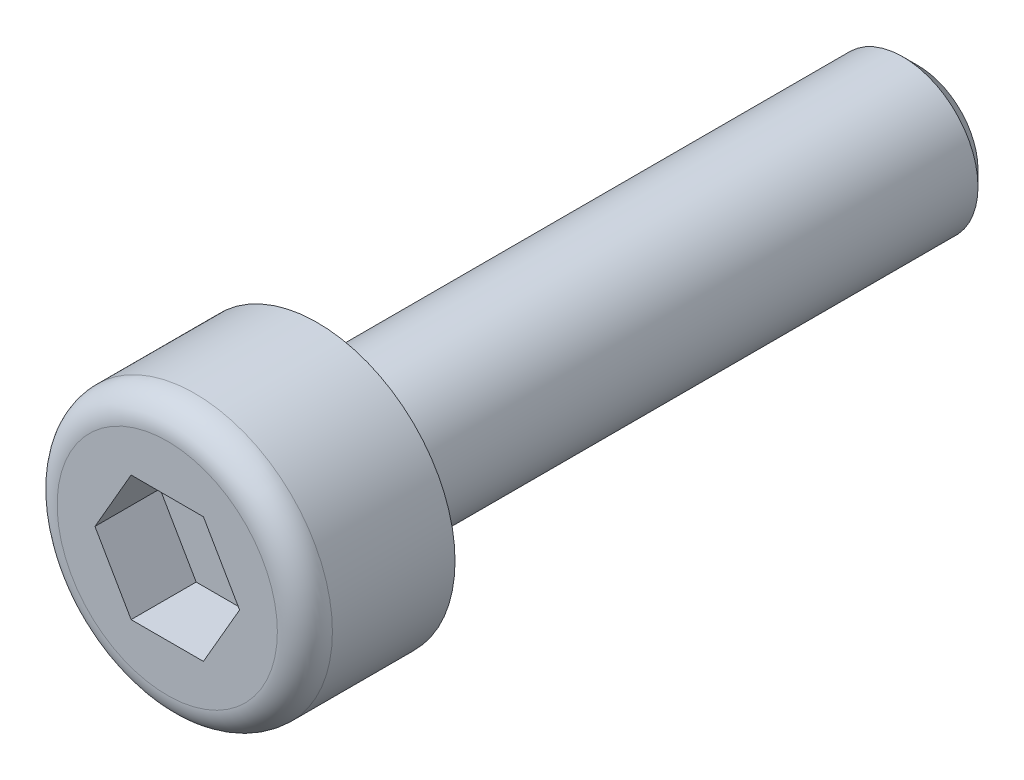
ISO-10303-21;
HEADER;
FILE_DESCRIPTION(('STEP AP214'),'2;1');
FILE_NAME('part.step','',(''),(''),'','','');
FILE_SCHEMA(('AUTOMOTIVE_DESIGN { 1 0 10303 214 1 1 1 1 }'));
ENDSEC;
DATA;
#1=APPLICATION_CONTEXT('core data for automotive mechanical design processes');
#2=APPLICATION_PROTOCOL_DEFINITION('international standard','automotive_design',2000,#1);
#3=PRODUCT_CONTEXT('',#1,'mechanical');
#4=PRODUCT('Part','Part','',(#3));
#5=PRODUCT_RELATED_PRODUCT_CATEGORY('part','',(#4));
#6=PRODUCT_DEFINITION_FORMATION('','',#4);
#7=PRODUCT_DEFINITION_CONTEXT('part definition',#1,'design');
#8=PRODUCT_DEFINITION('design','',#6,#7);
#9=PRODUCT_DEFINITION_SHAPE('','',#8);
#10=(LENGTH_UNIT() NAMED_UNIT(*) SI_UNIT(.MILLI.,.METRE.));
#11=(NAMED_UNIT(*) PLANE_ANGLE_UNIT() SI_UNIT($,.RADIAN.));
#12=(NAMED_UNIT(*) SI_UNIT($,.STERADIAN.) SOLID_ANGLE_UNIT());
#13=UNCERTAINTY_MEASURE_WITH_UNIT(LENGTH_MEASURE(1.E-05),#10,'distance_accuracy_value','');
#14=(GEOMETRIC_REPRESENTATION_CONTEXT(3) GLOBAL_UNCERTAINTY_ASSIGNED_CONTEXT((#13)) GLOBAL_UNIT_ASSIGNED_CONTEXT((#10,
#11,#12)) REPRESENTATION_CONTEXT('',''));
#15=CARTESIAN_POINT('',(0.,0.,0.));
#16=DIRECTION('',(0.,0.,1.));
#17=DIRECTION('',(1.,0.,0.));
#18=AXIS2_PLACEMENT_3D('',#15,#16,#17);
#19=CARTESIAN_POINT('',(0.,0.,1.7));
#20=DIRECTION('',(0.,0.,1.));
#21=DIRECTION('',(1.,0.,0.));
#22=AXIS2_PLACEMENT_3D('',#19,#20,#21);
#23=PLANE('',#22);
#24=DIRECTION('',(-0.50000000000019,0.866025403784329,0.));
#25=VECTOR('',#24,1.);
#26=CARTESIAN_POINT('',(1.445,0.,1.7));
#27=LINE('',#26,#25);
#28=CARTESIAN_POINT('',(1.445,0.,1.7));
#29=VERTEX_POINT('',#28);
#30=CARTESIAN_POINT('',(0.7225,1.251406708469,1.7));
#31=VERTEX_POINT('',#30);
#32=EDGE_CURVE('E11',#29,#31,#27,.T.);
#33=ORIENTED_EDGE('',*,*,#32,.T.);
#34=DIRECTION('',(-1.,0.,0.));
#35=VECTOR('',#34,1.);
#36=CARTESIAN_POINT('',(0.7225,1.251406708469,1.7));
#37=LINE('',#36,#35);
#38=CARTESIAN_POINT('',(-0.7225,1.251406708469,1.7));
#39=VERTEX_POINT('',#38);
#40=EDGE_CURVE('E25',#31,#39,#37,.T.);
#41=ORIENTED_EDGE('',*,*,#40,.T.);
#42=DIRECTION('',(-0.50000000000019,-0.866025403784329,0.));
#43=VECTOR('',#42,1.);
#44=CARTESIAN_POINT('',(-0.7225,1.251406708469,1.7));
#45=LINE('',#44,#43);
#46=CARTESIAN_POINT('',(-1.445,0.,1.7));
#47=VERTEX_POINT('',#46);
#48=EDGE_CURVE('E160',#39,#47,#45,.T.);
#49=ORIENTED_EDGE('',*,*,#48,.T.);
#50=DIRECTION('',(0.50000000000019,-0.866025403784329,0.));
#51=VECTOR('',#50,1.);
#52=CARTESIAN_POINT('',(-1.445,0.,1.7));
#53=LINE('',#52,#51);
#54=CARTESIAN_POINT('',(-0.7225,-1.251406708469,1.7));
#55=VERTEX_POINT('',#54);
#56=EDGE_CURVE('E195',#47,#55,#53,.T.);
#57=ORIENTED_EDGE('',*,*,#56,.T.);
#58=DIRECTION('',(1.,0.,0.));
#59=VECTOR('',#58,1.);
#60=CARTESIAN_POINT('',(-0.7225,-1.251406708469,1.7));
#61=LINE('',#60,#59);
#62=CARTESIAN_POINT('',(0.7225,-1.251406708469,1.7));
#63=VERTEX_POINT('',#62);
#64=EDGE_CURVE('E189',#55,#63,#61,.T.);
#65=ORIENTED_EDGE('',*,*,#64,.T.);
#66=DIRECTION('',(0.50000000000019,0.866025403784329,0.));
#67=VECTOR('',#66,1.);
#68=CARTESIAN_POINT('',(0.7225,-1.251406708469,1.7));
#69=LINE('',#68,#67);
#70=EDGE_CURVE('E183',#63,#29,#69,.T.);
#71=ORIENTED_EDGE('',*,*,#70,.T.);
#72=EDGE_LOOP('',(#33,#41,#49,#57,#65,#71));
#73=FACE_BOUND('',#72,.T.);
#74=ADVANCED_FACE('F17',(#73),#23,.T.);
#75=CARTESIAN_POINT('',(1.445,0.,1.7));
#76=DIRECTION('',(-0.866025403784329,-0.50000000000019,0.));
#77=DIRECTION('',(-0.50000000000019,0.866025403784329,0.));
#78=AXIS2_PLACEMENT_3D('',#75,#76,#77);
#79=PLANE('',#78);
#80=DIRECTION('',(0.,0.,1.));
#81=VECTOR('',#80,1.);
#82=CARTESIAN_POINT('',(1.445,0.,1.7));
#83=LINE('',#82,#81);
#84=CARTESIAN_POINT('',(1.445,0.,3.));
#85=VERTEX_POINT('',#84);
#86=EDGE_CURVE('E180',#29,#85,#83,.T.);
#87=ORIENTED_EDGE('',*,*,#86,.T.);
#88=DIRECTION('',(-0.50000000000019,0.866025403784329,0.));
#89=VECTOR('',#88,1.);
#90=CARTESIAN_POINT('',(1.445,0.,3.));
#91=LINE('',#90,#89);
#92=CARTESIAN_POINT('',(0.7225,1.251406708469,3.));
#93=VERTEX_POINT('',#92);
#94=EDGE_CURVE('E127',#85,#93,#91,.T.);
#95=ORIENTED_EDGE('',*,*,#94,.T.);
#96=DIRECTION('',(0.,0.,1.));
#97=VECTOR('',#96,1.);
#98=CARTESIAN_POINT('',(0.7225,1.251406708469,1.7));
#99=LINE('',#98,#97);
#100=EDGE_CURVE('E157',#31,#93,#99,.T.);
#101=ORIENTED_EDGE('',*,*,#100,.F.);
#102=ORIENTED_EDGE('',*,*,#32,.F.);
#103=EDGE_LOOP('',(#87,#95,#101,#102));
#104=FACE_BOUND('',#103,.T.);
#105=ADVANCED_FACE('F345',(#104),#79,.T.);
#106=CARTESIAN_POINT('',(0.7225,1.251406708469,1.7));
#107=DIRECTION('',(0.,-1.,0.));
#108=DIRECTION('',(-1.,0.,0.));
#109=AXIS2_PLACEMENT_3D('',#106,#107,#108);
#110=PLANE('',#109);
#111=ORIENTED_EDGE('',*,*,#100,.T.);
#112=DIRECTION('',(-1.,0.,0.));
#113=VECTOR('',#112,1.);
#114=CARTESIAN_POINT('',(0.7225,1.251406708469,3.));
#115=LINE('',#114,#113);
#116=CARTESIAN_POINT('',(-0.7225,1.251406708469,3.));
#117=VERTEX_POINT('',#116);
#118=EDGE_CURVE('E124',#93,#117,#115,.T.);
#119=ORIENTED_EDGE('',*,*,#118,.T.);
#120=DIRECTION('',(0.,0.,1.));
#121=VECTOR('',#120,1.);
#122=CARTESIAN_POINT('',(-0.7225,1.251406708469,1.7));
#123=LINE('',#122,#121);
#124=EDGE_CURVE('E198',#39,#117,#123,.T.);
#125=ORIENTED_EDGE('',*,*,#124,.F.);
#126=ORIENTED_EDGE('',*,*,#40,.F.);
#127=EDGE_LOOP('',(#111,#119,#125,#126));
#128=FACE_BOUND('',#127,.T.);
#129=ADVANCED_FACE('F340',(#128),#110,.T.);
#130=CARTESIAN_POINT('',(-0.7225,1.251406708469,1.7));
#131=DIRECTION('',(0.866025403784329,-0.50000000000019,0.));
#132=DIRECTION('',(0.,0.,-1.));
#133=AXIS2_PLACEMENT_3D('',#130,#131,#132);
#134=PLANE('',#133);
#135=ORIENTED_EDGE('',*,*,#124,.T.);
#136=DIRECTION('',(-0.50000000000019,-0.866025403784329,0.));
#137=VECTOR('',#136,1.);
#138=CARTESIAN_POINT('',(-0.7225,1.251406708469,3.));
#139=LINE('',#138,#137);
#140=CARTESIAN_POINT('',(-1.445,0.,3.));
#141=VERTEX_POINT('',#140);
#142=EDGE_CURVE('E128',#117,#141,#139,.T.);
#143=ORIENTED_EDGE('',*,*,#142,.T.);
#144=DIRECTION('',(0.,0.,1.));
#145=VECTOR('',#144,1.);
#146=CARTESIAN_POINT('',(-1.445,0.,1.7));
#147=LINE('',#146,#145);
#148=EDGE_CURVE('E192',#47,#141,#147,.T.);
#149=ORIENTED_EDGE('',*,*,#148,.F.);
#150=ORIENTED_EDGE('',*,*,#48,.F.);
#151=EDGE_LOOP('',(#135,#143,#149,#150));
#152=FACE_BOUND('',#151,.T.);
#153=ADVANCED_FACE('F309',(#152),#134,.T.);
#154=CARTESIAN_POINT('',(-1.445,0.,1.7));
#155=DIRECTION('',(0.866025403784329,0.50000000000019,0.));
#156=DIRECTION('',(0.,0.,-1.));
#157=AXIS2_PLACEMENT_3D('',#154,#155,#156);
#158=PLANE('',#157);
#159=ORIENTED_EDGE('',*,*,#148,.T.);
#160=DIRECTION('',(0.50000000000019,-0.866025403784329,0.));
#161=VECTOR('',#160,1.);
#162=CARTESIAN_POINT('',(-1.445,0.,3.));
#163=LINE('',#162,#161);
#164=CARTESIAN_POINT('',(-0.7225,-1.251406708469,3.));
#165=VERTEX_POINT('',#164);
#166=EDGE_CURVE('E133',#141,#165,#163,.T.);
#167=ORIENTED_EDGE('',*,*,#166,.T.);
#168=DIRECTION('',(0.,0.,1.));
#169=VECTOR('',#168,1.);
#170=CARTESIAN_POINT('',(-0.7225,-1.251406708469,1.7));
#171=LINE('',#170,#169);
#172=EDGE_CURVE('E186',#55,#165,#171,.T.);
#173=ORIENTED_EDGE('',*,*,#172,.F.);
#174=ORIENTED_EDGE('',*,*,#56,.F.);
#175=EDGE_LOOP('',(#159,#167,#173,#174));
#176=FACE_BOUND('',#175,.T.);
#177=ADVANCED_FACE('F304',(#176),#158,.T.);
#178=CARTESIAN_POINT('',(-0.7225,-1.251406708469,1.7));
#179=DIRECTION('',(0.,1.,0.));
#180=DIRECTION('',(1.,0.,0.));
#181=AXIS2_PLACEMENT_3D('',#178,#179,#180);
#182=PLANE('',#181);
#183=ORIENTED_EDGE('',*,*,#172,.T.);
#184=DIRECTION('',(1.,0.,0.));
#185=VECTOR('',#184,1.);
#186=CARTESIAN_POINT('',(-0.7225,-1.251406708469,3.));
#187=LINE('',#186,#185);
#188=CARTESIAN_POINT('',(0.7225,-1.251406708469,3.));
#189=VERTEX_POINT('',#188);
#190=EDGE_CURVE('E144',#165,#189,#187,.T.);
#191=ORIENTED_EDGE('',*,*,#190,.T.);
#192=DIRECTION('',(0.,0.,1.));
#193=VECTOR('',#192,1.);
#194=CARTESIAN_POINT('',(0.7225,-1.251406708469,1.7));
#195=LINE('',#194,#193);
#196=EDGE_CURVE('E171',#63,#189,#195,.T.);
#197=ORIENTED_EDGE('',*,*,#196,.F.);
#198=ORIENTED_EDGE('',*,*,#64,.F.);
#199=EDGE_LOOP('',(#183,#191,#197,#198));
#200=FACE_BOUND('',#199,.T.);
#201=ADVANCED_FACE('F269',(#200),#182,.T.);
#202=CARTESIAN_POINT('',(0.7225,-1.251406708469,1.7));
#203=DIRECTION('',(-0.866025403784329,0.50000000000019,0.));
#204=DIRECTION('',(0.,0.,1.));
#205=AXIS2_PLACEMENT_3D('',#202,#203,#204);
#206=PLANE('',#205);
#207=ORIENTED_EDGE('',*,*,#196,.T.);
#208=DIRECTION('',(0.50000000000019,0.866025403784329,0.));
#209=VECTOR('',#208,1.);
#210=CARTESIAN_POINT('',(0.7225,-1.251406708469,3.));
#211=LINE('',#210,#209);
#212=EDGE_CURVE('E167',#189,#85,#211,.T.);
#213=ORIENTED_EDGE('',*,*,#212,.T.);
#214=ORIENTED_EDGE('',*,*,#86,.F.);
#215=ORIENTED_EDGE('',*,*,#70,.F.);
#216=EDGE_LOOP('',(#207,#213,#214,#215));
#217=FACE_BOUND('',#216,.T.);
#218=ADVANCED_FACE('F263',(#217),#206,.T.);
#219=CARTESIAN_POINT('',(0.,0.,3.));
#220=DIRECTION('',(0.,0.,1.));
#221=DIRECTION('',(1.,0.,0.));
#222=AXIS2_PLACEMENT_3D('',#219,#220,#221);
#223=PLANE('',#222);
#224=ORIENTED_EDGE('',*,*,#190,.F.);
#225=ORIENTED_EDGE('',*,*,#166,.F.);
#226=ORIENTED_EDGE('',*,*,#142,.F.);
#227=ORIENTED_EDGE('',*,*,#118,.F.);
#228=ORIENTED_EDGE('',*,*,#94,.F.);
#229=ORIENTED_EDGE('',*,*,#212,.F.);
#230=EDGE_LOOP('',(#224,#225,#226,#227,#228,#229));
#231=FACE_BOUND('',#230,.T.);
#232=CARTESIAN_POINT('',(0.,0.,3.));
#233=DIRECTION('',(0.,0.,1.));
#234=DIRECTION('',(1.,0.,0.));
#235=AXIS2_PLACEMENT_3D('',#232,#233,#234);
#236=CIRCLE('',#235,2.2);
#237=CARTESIAN_POINT('',(2.2,0.,3.));
#238=VERTEX_POINT('',#237);
#239=EDGE_CURVE('E164',#238,#238,#236,.T.);
#240=ORIENTED_EDGE('',*,*,#239,.T.);
#241=EDGE_LOOP('',(#240));
#242=FACE_BOUND('',#241,.T.);
#243=ADVANCED_FACE('F268',(#231,#242),#223,.T.);
#244=CARTESIAN_POINT('',(0.,0.,2.45));
#245=DIRECTION('',(0.,0.,1.));
#246=DIRECTION('',(1.,0.,0.));
#247=AXIS2_PLACEMENT_3D('',#244,#245,#246);
#248=TOROIDAL_SURFACE('',#247,2.2,0.55);
#249=CARTESIAN_POINT('',(0.,0.,2.45));
#250=DIRECTION('',(0.,0.,1.));
#251=DIRECTION('',(1.,0.,0.));
#252=AXIS2_PLACEMENT_3D('',#249,#250,#251);
#253=CIRCLE('',#252,2.75);
#254=CARTESIAN_POINT('',(2.75,0.,2.45));
#255=VERTEX_POINT('',#254);
#256=EDGE_CURVE('E145',#255,#255,#253,.T.);
#257=ORIENTED_EDGE('',*,*,#256,.T.);
#258=CARTESIAN_POINT('',(2.2,0.,2.45));
#259=DIRECTION('',(0.,-1.,0.));
#260=DIRECTION('',(1.,0.,0.));
#261=AXIS2_PLACEMENT_3D('',#258,#259,#260);
#262=CIRCLE('',#261,0.55);
#263=EDGE_CURVE('E149',#255,#238,#262,.T.);
#264=ORIENTED_EDGE('',*,*,#263,.T.);
#265=ORIENTED_EDGE('',*,*,#239,.F.);
#266=ORIENTED_EDGE('',*,*,#263,.F.);
#267=EDGE_LOOP('',(#257,#264,#265,#266));
#268=FACE_BOUND('',#267,.T.);
#269=ADVANCED_FACE('F327',(#268),#248,.T.);
#270=CARTESIAN_POINT('',(0.,0.,0.));
#271=DIRECTION('',(0.,0.,1.));
#272=DIRECTION('',(1.,0.,0.));
#273=AXIS2_PLACEMENT_3D('',#270,#271,#272);
#274=CYLINDRICAL_SURFACE('',#273,2.75);
#275=CARTESIAN_POINT('',(0.,0.,0.));
#276=DIRECTION('',(0.,0.,1.));
#277=DIRECTION('',(1.,0.,0.));
#278=AXIS2_PLACEMENT_3D('',#275,#276,#277);
#279=CIRCLE('',#278,2.75);
#280=CARTESIAN_POINT('',(2.75,0.,0.));
#281=VERTEX_POINT('',#280);
#282=EDGE_CURVE('E140',#281,#281,#279,.T.);
#283=ORIENTED_EDGE('',*,*,#282,.T.);
#284=DIRECTION('',(0.,0.,1.));
#285=VECTOR('',#284,1.);
#286=CARTESIAN_POINT('',(2.75,0.,0.));
#287=LINE('',#286,#285);
#288=EDGE_CURVE('E150',#281,#255,#287,.T.);
#289=ORIENTED_EDGE('',*,*,#288,.T.);
#290=ORIENTED_EDGE('',*,*,#256,.F.);
#291=ORIENTED_EDGE('',*,*,#288,.F.);
#292=EDGE_LOOP('',(#283,#289,#290,#291));
#293=FACE_BOUND('',#292,.T.);
#294=ADVANCED_FACE('F318',(#293),#274,.T.);
#295=CARTESIAN_POINT('',(0.,0.,0.));
#296=DIRECTION('',(0.,0.,1.));
#297=DIRECTION('',(1.,0.,0.));
#298=AXIS2_PLACEMENT_3D('',#295,#296,#297);
#299=PLANE('',#298);
#300=ORIENTED_EDGE('',*,*,#282,.F.);
#301=EDGE_LOOP('',(#300));
#302=FACE_BOUND('',#301,.T.);
#303=CARTESIAN_POINT('',(0.,0.,0.));
#304=DIRECTION('',(0.,0.,1.));
#305=DIRECTION('',(1.,0.,0.));
#306=AXIS2_PLACEMENT_3D('',#303,#304,#305);
#307=CIRCLE('',#306,1.5);
#308=CARTESIAN_POINT('',(1.5,0.,0.));
#309=VERTEX_POINT('',#308);
#310=EDGE_CURVE('E137',#309,#309,#307,.T.);
#311=ORIENTED_EDGE('',*,*,#310,.T.);
#312=EDGE_LOOP('',(#311));
#313=FACE_BOUND('',#312,.T.);
#314=ADVANCED_FACE('F298',(#302,#313),#299,.F.);
#315=CARTESIAN_POINT('',(0.,0.,-11.7));
#316=DIRECTION('',(0.,0.,1.));
#317=DIRECTION('',(1.,0.,0.));
#318=AXIS2_PLACEMENT_3D('',#315,#316,#317);
#319=CYLINDRICAL_SURFACE('',#318,1.5);
#320=CARTESIAN_POINT('',(0.,0.,-11.7));
#321=DIRECTION('',(0.,0.,1.));
#322=DIRECTION('',(1.,0.,0.));
#323=AXIS2_PLACEMENT_3D('',#320,#321,#322);
#324=CIRCLE('',#323,1.5);
#325=CARTESIAN_POINT('',(1.5,0.,-11.7));
#326=VERTEX_POINT('',#325);
#327=EDGE_CURVE('E113',#326,#326,#324,.T.);
#328=ORIENTED_EDGE('',*,*,#327,.T.);
#329=DIRECTION('',(0.,0.,1.));
#330=VECTOR('',#329,1.);
#331=CARTESIAN_POINT('',(1.5,0.,-11.7));
#332=LINE('',#331,#330);
#333=EDGE_CURVE('E120',#326,#309,#332,.T.);
#334=ORIENTED_EDGE('',*,*,#333,.T.);
#335=ORIENTED_EDGE('',*,*,#310,.F.);
#336=ORIENTED_EDGE('',*,*,#333,.F.);
#337=EDGE_LOOP('',(#328,#334,#335,#336));
#338=FACE_BOUND('',#337,.T.);
#339=ADVANCED_FACE('F290',(#338),#319,.T.);
#340=CARTESIAN_POINT('',(0.,0.,-12.));
#341=DIRECTION('',(0.,0.,1.));
#342=DIRECTION('',(1.,0.,0.));
#343=AXIS2_PLACEMENT_3D('',#340,#341,#342);
#344=CONICAL_SURFACE('',#343,1.2,0.785398163397);
#345=CARTESIAN_POINT('',(0.,0.,-12.));
#346=DIRECTION('',(0.,0.,1.));
#347=DIRECTION('',(1.,0.,0.));
#348=AXIS2_PLACEMENT_3D('',#345,#346,#347);
#349=CIRCLE('',#348,1.2);
#350=CARTESIAN_POINT('',(1.2,0.,-12.));
#351=VERTEX_POINT('',#350);
#352=EDGE_CURVE('E111',#351,#351,#349,.T.);
#353=ORIENTED_EDGE('',*,*,#352,.T.);
#354=DIRECTION('',(0.707106781186548,0.,0.707106781186548));
#355=VECTOR('',#354,1.);
#356=CARTESIAN_POINT('',(1.2,0.,-12.));
#357=LINE('',#356,#355);
#358=EDGE_CURVE('E108',#351,#326,#357,.T.);
#359=ORIENTED_EDGE('',*,*,#358,.T.);
#360=ORIENTED_EDGE('',*,*,#327,.F.);
#361=ORIENTED_EDGE('',*,*,#358,.F.);
#362=EDGE_LOOP('',(#353,#359,#360,#361));
#363=FACE_BOUND('',#362,.T.);
#364=ADVANCED_FACE('F109',(#363),#344,.T.);
#365=CARTESIAN_POINT('',(0.,0.,-12.));
#366=DIRECTION('',(0.,0.,1.));
#367=DIRECTION('',(1.,0.,0.));
#368=AXIS2_PLACEMENT_3D('',#365,#366,#367);
#369=PLANE('',#368);
#370=ORIENTED_EDGE('',*,*,#352,.F.);
#371=EDGE_LOOP('',(#370));
#372=FACE_BOUND('',#371,.T.);
#373=ADVANCED_FACE('F277',(#372),#369,.F.);
#374=CLOSED_SHELL('',(#74,#105,#129,#153,#177,#201,#218,#243,#269,#294,#314,#339,#364,#373));
#375=MANIFOLD_SOLID_BREP('B1',#374);
#376=ADVANCED_BREP_SHAPE_REPRESENTATION('',(#18,#375),#14);
#377=SHAPE_DEFINITION_REPRESENTATION(#9,#376);
ENDSEC;
END-ISO-10303-21;
